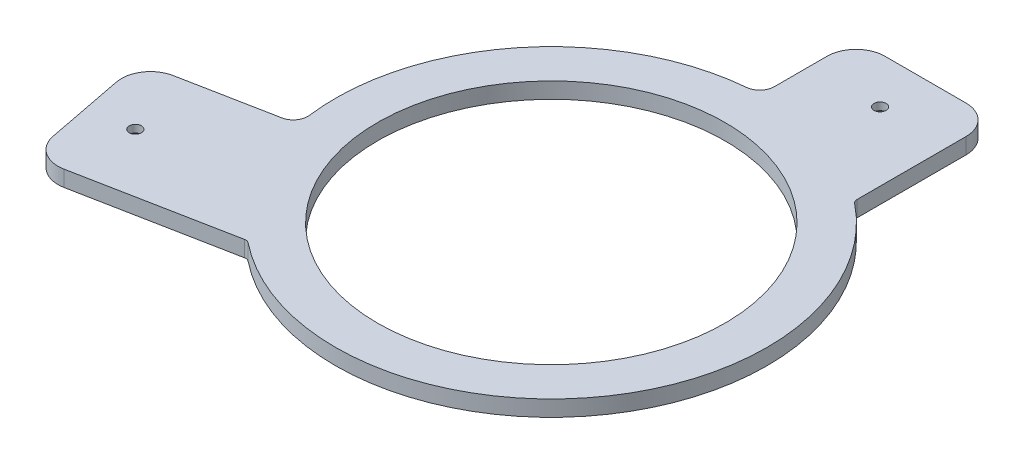
ISO-10303-21;
HEADER;
FILE_DESCRIPTION(('STEP AP214'),'2;1');
FILE_NAME('part.step','',(''),(''),'','','');
FILE_SCHEMA(('AUTOMOTIVE_DESIGN { 1 0 10303 214 1 1 1 1 }'));
ENDSEC;
DATA;
#1=APPLICATION_CONTEXT('core data for automotive mechanical design processes');
#2=APPLICATION_PROTOCOL_DEFINITION('international standard','automotive_design',2000,#1);
#3=PRODUCT_CONTEXT('',#1,'mechanical');
#4=PRODUCT('Part','Part','',(#3));
#5=PRODUCT_RELATED_PRODUCT_CATEGORY('part','',(#4));
#6=PRODUCT_DEFINITION_FORMATION('','',#4);
#7=PRODUCT_DEFINITION_CONTEXT('part definition',#1,'design');
#8=PRODUCT_DEFINITION('design','',#6,#7);
#9=PRODUCT_DEFINITION_SHAPE('','',#8);
#10=(LENGTH_UNIT() NAMED_UNIT(*) SI_UNIT(.MILLI.,.METRE.));
#11=(NAMED_UNIT(*) PLANE_ANGLE_UNIT() SI_UNIT($,.RADIAN.));
#12=(NAMED_UNIT(*) SI_UNIT($,.STERADIAN.) SOLID_ANGLE_UNIT());
#13=UNCERTAINTY_MEASURE_WITH_UNIT(LENGTH_MEASURE(1.E-05),#10,'distance_accuracy_value','');
#14=(GEOMETRIC_REPRESENTATION_CONTEXT(3) GLOBAL_UNCERTAINTY_ASSIGNED_CONTEXT((#13)) GLOBAL_UNIT_ASSIGNED_CONTEXT((#10,
#11,#12)) REPRESENTATION_CONTEXT('',''));
#15=CARTESIAN_POINT('',(0.,0.,0.));
#16=DIRECTION('',(0.,0.,1.));
#17=DIRECTION('',(1.,0.,0.));
#18=AXIS2_PLACEMENT_3D('',#15,#16,#17);
#19=CARTESIAN_POINT('',(0.,5.5,0.));
#20=DIRECTION('',(0.,1.,0.));
#21=DIRECTION('',(0.,0.,1.));
#22=AXIS2_PLACEMENT_3D('',#19,#20,#21);
#23=PLANE('',#22);
#24=CARTESIAN_POINT('',(22.1,5.50000000000001,-91.4));
#25=DIRECTION('',(0.,-1.,0.));
#26=DIRECTION('',(0.,0.,-1.));
#27=AXIS2_PLACEMENT_3D('',#24,#25,#26);
#28=CIRCLE('',#27,2.09999999999999);
#29=CARTESIAN_POINT('',(22.1,5.50000000000001,-93.5));
#30=VERTEX_POINT('',#29);
#31=EDGE_CURVE('E471',#30,#30,#28,.T.);
#32=ORIENTED_EDGE('',*,*,#31,.T.);
#33=EDGE_LOOP('',(#32));
#34=FACE_BOUND('',#33,.T.);
#35=CARTESIAN_POINT('',(-99.7675537114497,5.50000000000001,43.8420486112704));
#36=DIRECTION('',(0.,-1.,0.));
#37=DIRECTION('',(0.,0.,-1.));
#38=AXIS2_PLACEMENT_3D('',#35,#36,#37);
#39=CIRCLE('',#38,2.09999999999999);
#40=CARTESIAN_POINT('',(-99.7675537114497,5.50000000000001,41.7420486112704));
#41=VERTEX_POINT('',#40);
#42=EDGE_CURVE('E290',#41,#41,#39,.T.);
#43=ORIENTED_EDGE('',*,*,#42,.T.);
#44=EDGE_LOOP('',(#43));
#45=FACE_BOUND('',#44,.T.);
#46=CARTESIAN_POINT('',(0.,5.5,0.));
#47=DIRECTION('',(0.,1.,0.));
#48=DIRECTION('',(0.,0.,1.));
#49=AXIS2_PLACEMENT_3D('',#46,#47,#48);
#50=CIRCLE('',#49,74.5);
#51=CARTESIAN_POINT('',(-46.3600724543547,5.5,58.3180390790619));
#52=VERTEX_POINT('',#51);
#53=CARTESIAN_POINT('',(46.6050228310502,5.5,-58.1224728217691));
#54=VERTEX_POINT('',#53);
#55=EDGE_CURVE('E159',#52,#54,#50,.T.);
#56=ORIENTED_EDGE('',*,*,#55,.T.);
#57=CARTESIAN_POINT('',(47.95,5.5,-59.7998327756859));
#58=DIRECTION('',(0.,1.,0.));
#59=DIRECTION('',(0.,0.,1.));
#60=AXIS2_PLACEMENT_3D('',#57,#58,#59);
#61=CIRCLE('',#60,2.15);
#62=CARTESIAN_POINT('',(45.8,5.5,-59.7998327756859));
#63=VERTEX_POINT('',#62);
#64=EDGE_CURVE('E11',#54,#63,#61,.F.);
#65=ORIENTED_EDGE('',*,*,#64,.T.);
#66=DIRECTION('',(0.,0.,-1.));
#67=VECTOR('',#66,1.);
#68=CARTESIAN_POINT('',(45.8,5.5,-107.4));
#69=LINE('',#68,#67);
#70=CARTESIAN_POINT('',(45.8,5.5,-97.4));
#71=VERTEX_POINT('',#70);
#72=EDGE_CURVE('E252',#63,#71,#69,.T.);
#73=ORIENTED_EDGE('',*,*,#72,.T.);
#74=CARTESIAN_POINT('',(35.8,5.5,-97.4));
#75=DIRECTION('',(0.,1.,0.));
#76=DIRECTION('',(0.,0.,1.));
#77=AXIS2_PLACEMENT_3D('',#74,#75,#76);
#78=CIRCLE('',#77,10.);
#79=CARTESIAN_POINT('',(35.8,5.5,-107.4));
#80=VERTEX_POINT('',#79);
#81=EDGE_CURVE('E211',#71,#80,#78,.T.);
#82=ORIENTED_EDGE('',*,*,#81,.T.);
#83=DIRECTION('',(-1.,0.,0.));
#84=VECTOR('',#83,1.);
#85=CARTESIAN_POINT('',(-2.2,5.5,-107.4));
#86=LINE('',#85,#84);
#87=CARTESIAN_POINT('',(7.80000000000001,5.5,-107.4));
#88=VERTEX_POINT('',#87);
#89=EDGE_CURVE('E264',#80,#88,#86,.T.);
#90=ORIENTED_EDGE('',*,*,#89,.T.);
#91=CARTESIAN_POINT('',(7.8,5.5,-97.4));
#92=DIRECTION('',(0.,1.,0.));
#93=DIRECTION('',(0.,0.,1.));
#94=AXIS2_PLACEMENT_3D('',#91,#92,#93);
#95=CIRCLE('',#94,10.);
#96=CARTESIAN_POINT('',(-2.2,5.5,-97.4));
#97=VERTEX_POINT('',#96);
#98=EDGE_CURVE('E209',#88,#97,#95,.T.);
#99=ORIENTED_EDGE('',*,*,#98,.T.);
#100=DIRECTION('',(0.,0.,1.));
#101=VECTOR('',#100,1.);
#102=CARTESIAN_POINT('',(-2.2,5.5,-107.4));
#103=LINE('',#102,#101);
#104=CARTESIAN_POINT('',(-2.19999999999999,5.5,-79.1732909509261));
#105=VERTEX_POINT('',#104);
#106=EDGE_CURVE('E269',#97,#105,#103,.T.);
#107=ORIENTED_EDGE('',*,*,#106,.T.);
#108=CARTESIAN_POINT('',(-7.19999999999999,5.5,-79.1732909509261));
#109=DIRECTION('',(0.,1.,0.));
#110=DIRECTION('',(0.,0.,1.));
#111=AXIS2_PLACEMENT_3D('',#108,#109,#110);
#112=CIRCLE('',#111,5.);
#113=CARTESIAN_POINT('',(-6.74716981132075,5.5,-74.1938386898616));
#114=VERTEX_POINT('',#113);
#115=EDGE_CURVE('E239',#105,#114,#112,.F.);
#116=ORIENTED_EDGE('',*,*,#115,.T.);
#117=CARTESIAN_POINT('',(0.,5.5,0.));
#118=DIRECTION('',(0.,1.,0.));
#119=DIRECTION('',(0.,0.,1.));
#120=AXIS2_PLACEMENT_3D('',#117,#118,#119);
#121=CIRCLE('',#120,74.5);
#122=CARTESIAN_POINT('',(-73.8804872688828,5.5,9.58767964173002));
#123=VERTEX_POINT('',#122);
#124=EDGE_CURVE('E272',#114,#123,#121,.T.);
#125=ORIENTED_EDGE('',*,*,#124,.T.);
#126=CARTESIAN_POINT('',(-78.8389092332374,5.5,10.2311480740609));
#127=DIRECTION('',(0.,1.,0.));
#128=DIRECTION('',(0.,0.,1.));
#129=AXIS2_PLACEMENT_3D('',#126,#127,#128);
#130=CIRCLE('',#129,5.);
#131=CARTESIAN_POINT('',(-77.8848642563547,5.5,15.1392839912992));
#132=VERTEX_POINT('',#131);
#133=EDGE_CURVE('E243',#123,#132,#130,.F.);
#134=ORIENTED_EDGE('',*,*,#133,.T.);
#135=DIRECTION('',(-0.981627183447664,0.,0.190808995376542));
#136=VECTOR('',#135,1.);
#137=CARTESIAN_POINT('',(-119.071377352202,5.5,23.1451311391745));
#138=LINE('',#137,#136);
#139=CARTESIAN_POINT('',(-109.255105517725,5.5,21.2370411854091));
#140=VERTEX_POINT('',#139);
#141=EDGE_CURVE('E160',#132,#140,#138,.T.);
#142=ORIENTED_EDGE('',*,*,#141,.T.);
#143=CARTESIAN_POINT('',(-107.34701556396,5.5,31.0533130198858));
#144=DIRECTION('',(0.,1.,0.));
#145=DIRECTION('',(0.,0.,1.));
#146=AXIS2_PLACEMENT_3D('',#143,#144,#145);
#147=CIRCLE('',#146,10.);
#148=CARTESIAN_POINT('',(-117.163287398436,5.5,32.9614029736512));
#149=VERTEX_POINT('',#148);
#150=EDGE_CURVE('E207',#140,#149,#147,.T.);
#151=ORIENTED_EDGE('',*,*,#150,.T.);
#152=DIRECTION('',(0.190808995376542,0.,0.981627183447665));
#153=VECTOR('',#152,1.);
#154=CARTESIAN_POINT('',(-119.071377352202,5.5,23.1451311391745));
#155=LINE('',#154,#153);
#156=CARTESIAN_POINT('',(-111.877878226506,5.5,60.1524759551515));
#157=VERTEX_POINT('',#156);
#158=EDGE_CURVE('E183',#149,#157,#155,.T.);
#159=ORIENTED_EDGE('',*,*,#158,.T.);
#160=CARTESIAN_POINT('',(-102.061606392029,5.5,58.2443860013861));
#161=DIRECTION('',(0.,1.,0.));
#162=DIRECTION('',(0.,0.,1.));
#163=AXIS2_PLACEMENT_3D('',#160,#161,#162);
#164=CIRCLE('',#163,10.);
#165=CARTESIAN_POINT('',(-100.153516438264,5.5,68.0606578358627));
#166=VERTEX_POINT('',#165);
#167=EDGE_CURVE('E205',#157,#166,#164,.T.);
#168=ORIENTED_EDGE('',*,*,#167,.T.);
#169=DIRECTION('',(0.981627183447664,0.,-0.190808995376542));
#170=VECTOR('',#169,1.);
#171=CARTESIAN_POINT('',(-109.969788272741,5.5,69.9687477896281));
#172=LINE('',#171,#170);
#173=CARTESIAN_POINT('',(-47.9862561485804,5.5,57.9203696538863));
#174=VERTEX_POINT('',#173);
#175=EDGE_CURVE('E297',#166,#174,#172,.T.);
#176=ORIENTED_EDGE('',*,*,#175,.T.);
#177=CARTESIAN_POINT('',(-47.6046381578273,5.5,59.8836240207817));
#178=DIRECTION('',(0.,1.,0.));
#179=DIRECTION('',(0.,0.,1.));
#180=AXIS2_PLACEMENT_3D('',#177,#178,#179);
#181=CIRCLE('',#180,2.);
#182=EDGE_CURVE('E155',#174,#52,#181,.F.);
#183=ORIENTED_EDGE('',*,*,#182,.T.);
#184=EDGE_LOOP('',(#56,#65,#73,#82,#90,#99,#107,#116,#125,#134,#142,#151,#159,#168,#176,#183));
#185=FACE_BOUND('',#184,.T.);
#186=CARTESIAN_POINT('',(0.,5.5,0.));
#187=DIRECTION('',(0.,1.,0.));
#188=DIRECTION('',(0.,0.,1.));
#189=AXIS2_PLACEMENT_3D('',#186,#187,#188);
#190=CIRCLE('',#189,60.);
#191=CARTESIAN_POINT('',(0.,5.5,60.));
#192=VERTEX_POINT('',#191);
#193=EDGE_CURVE('E280',#192,#192,#190,.T.);
#194=ORIENTED_EDGE('',*,*,#193,.F.);
#195=EDGE_LOOP('',(#194));
#196=FACE_BOUND('',#195,.T.);
#197=ADVANCED_FACE('F33',(#34,#45,#185,#196),#23,.T.);
#198=CARTESIAN_POINT('',(0.,0.,0.));
#199=DIRECTION('',(0.,1.,0.));
#200=DIRECTION('',(0.,0.,1.));
#201=AXIS2_PLACEMENT_3D('',#198,#199,#200);
#202=PLANE('',#201);
#203=CARTESIAN_POINT('',(22.1,0.,-91.4));
#204=DIRECTION('',(0.,-1.,0.));
#205=DIRECTION('',(0.,0.,-1.));
#206=AXIS2_PLACEMENT_3D('',#203,#204,#205);
#207=CIRCLE('',#206,5.);
#208=CARTESIAN_POINT('',(22.1,0.,-96.4));
#209=VERTEX_POINT('',#208);
#210=EDGE_CURVE('E469',#209,#209,#207,.T.);
#211=ORIENTED_EDGE('',*,*,#210,.F.);
#212=EDGE_LOOP('',(#211));
#213=FACE_BOUND('',#212,.T.);
#214=CARTESIAN_POINT('',(-99.7675537114497,0.,43.8420486112704));
#215=DIRECTION('',(0.,-1.,0.));
#216=DIRECTION('',(0.,0.,-1.));
#217=AXIS2_PLACEMENT_3D('',#214,#215,#216);
#218=CIRCLE('',#217,5.);
#219=CARTESIAN_POINT('',(-99.7675537114497,0.,38.8420486112704));
#220=VERTEX_POINT('',#219);
#221=EDGE_CURVE('E475',#220,#220,#218,.T.);
#222=ORIENTED_EDGE('',*,*,#221,.F.);
#223=EDGE_LOOP('',(#222));
#224=FACE_BOUND('',#223,.T.);
#225=DIRECTION('',(-1.,0.,0.));
#226=VECTOR('',#225,1.);
#227=CARTESIAN_POINT('',(-2.2,0.,-107.4));
#228=LINE('',#227,#226);
#229=CARTESIAN_POINT('',(35.8,0.,-107.4));
#230=VERTEX_POINT('',#229);
#231=CARTESIAN_POINT('',(7.80000000000001,0.,-107.4));
#232=VERTEX_POINT('',#231);
#233=EDGE_CURVE('E168',#230,#232,#228,.T.);
#234=ORIENTED_EDGE('',*,*,#233,.F.);
#235=CARTESIAN_POINT('',(35.8,0.,-97.4));
#236=DIRECTION('',(0.,1.,0.));
#237=DIRECTION('',(0.,0.,1.));
#238=AXIS2_PLACEMENT_3D('',#235,#236,#237);
#239=CIRCLE('',#238,10.);
#240=CARTESIAN_POINT('',(45.8,0.,-97.4));
#241=VERTEX_POINT('',#240);
#242=EDGE_CURVE('E199',#230,#241,#239,.F.);
#243=ORIENTED_EDGE('',*,*,#242,.T.);
#244=DIRECTION('',(0.,0.,-1.));
#245=VECTOR('',#244,1.);
#246=CARTESIAN_POINT('',(45.8,0.,-107.4));
#247=LINE('',#246,#245);
#248=CARTESIAN_POINT('',(45.8,0.,-59.7998327756859));
#249=VERTEX_POINT('',#248);
#250=EDGE_CURVE('E165',#249,#241,#247,.T.);
#251=ORIENTED_EDGE('',*,*,#250,.F.);
#252=CARTESIAN_POINT('',(47.95,0.,-59.7998327756859));
#253=DIRECTION('',(0.,1.,0.));
#254=DIRECTION('',(0.,0.,1.));
#255=AXIS2_PLACEMENT_3D('',#252,#253,#254);
#256=CIRCLE('',#255,2.15);
#257=CARTESIAN_POINT('',(46.6050228310502,0.,-58.1224728217691));
#258=VERTEX_POINT('',#257);
#259=EDGE_CURVE('E41',#249,#258,#256,.T.);
#260=ORIENTED_EDGE('',*,*,#259,.T.);
#261=CARTESIAN_POINT('',(0.,0.,0.));
#262=DIRECTION('',(0.,1.,0.));
#263=DIRECTION('',(0.,0.,1.));
#264=AXIS2_PLACEMENT_3D('',#261,#262,#263);
#265=CIRCLE('',#264,74.5);
#266=CARTESIAN_POINT('',(-46.3600724543547,0.,58.3180390790619));
#267=VERTEX_POINT('',#266);
#268=EDGE_CURVE('E158',#267,#258,#265,.T.);
#269=ORIENTED_EDGE('',*,*,#268,.F.);
#270=CARTESIAN_POINT('',(-47.6046381578273,0.,59.8836240207817));
#271=DIRECTION('',(0.,1.,0.));
#272=DIRECTION('',(0.,0.,1.));
#273=AXIS2_PLACEMENT_3D('',#270,#271,#272);
#274=CIRCLE('',#273,2.);
#275=CARTESIAN_POINT('',(-47.9862561485804,0.,57.9203696538863));
#276=VERTEX_POINT('',#275);
#277=EDGE_CURVE('E147',#267,#276,#274,.T.);
#278=ORIENTED_EDGE('',*,*,#277,.T.);
#279=DIRECTION('',(0.981627183447664,0.,-0.190808995376542));
#280=VECTOR('',#279,1.);
#281=CARTESIAN_POINT('',(-109.969788272741,0.,69.9687477896281));
#282=LINE('',#281,#280);
#283=CARTESIAN_POINT('',(-100.153516438264,0.,68.0606578358627));
#284=VERTEX_POINT('',#283);
#285=EDGE_CURVE('E166',#284,#276,#282,.T.);
#286=ORIENTED_EDGE('',*,*,#285,.F.);
#287=CARTESIAN_POINT('',(-102.061606392029,0.,58.2443860013861));
#288=DIRECTION('',(0.,1.,0.));
#289=DIRECTION('',(0.,0.,1.));
#290=AXIS2_PLACEMENT_3D('',#287,#288,#289);
#291=CIRCLE('',#290,10.);
#292=CARTESIAN_POINT('',(-111.877878226506,0.,60.1524759551515));
#293=VERTEX_POINT('',#292);
#294=EDGE_CURVE('E192',#284,#293,#291,.F.);
#295=ORIENTED_EDGE('',*,*,#294,.T.);
#296=DIRECTION('',(0.190808995376542,0.,0.981627183447665));
#297=VECTOR('',#296,1.);
#298=CARTESIAN_POINT('',(-119.071377352202,0.,23.1451311391745));
#299=LINE('',#298,#297);
#300=CARTESIAN_POINT('',(-117.163287398436,0.,32.9614029736512));
#301=VERTEX_POINT('',#300);
#302=EDGE_CURVE('E170',#301,#293,#299,.T.);
#303=ORIENTED_EDGE('',*,*,#302,.F.);
#304=CARTESIAN_POINT('',(-107.34701556396,0.,31.0533130198858));
#305=DIRECTION('',(0.,1.,0.));
#306=DIRECTION('',(0.,0.,1.));
#307=AXIS2_PLACEMENT_3D('',#304,#305,#306);
#308=CIRCLE('',#307,10.);
#309=CARTESIAN_POINT('',(-109.255105517725,0.,21.2370411854091));
#310=VERTEX_POINT('',#309);
#311=EDGE_CURVE('E194',#301,#310,#308,.F.);
#312=ORIENTED_EDGE('',*,*,#311,.T.);
#313=DIRECTION('',(-0.981627183447664,0.,0.190808995376542));
#314=VECTOR('',#313,1.);
#315=CARTESIAN_POINT('',(-119.071377352202,0.,23.1451311391745));
#316=LINE('',#315,#314);
#317=CARTESIAN_POINT('',(-77.8848642563547,0.,15.1392839912992));
#318=VERTEX_POINT('',#317);
#319=EDGE_CURVE('E182',#318,#310,#316,.T.);
#320=ORIENTED_EDGE('',*,*,#319,.F.);
#321=CARTESIAN_POINT('',(-78.8389092332374,0.,10.2311480740609));
#322=DIRECTION('',(0.,1.,0.));
#323=DIRECTION('',(0.,0.,1.));
#324=AXIS2_PLACEMENT_3D('',#321,#322,#323);
#325=CIRCLE('',#324,5.);
#326=CARTESIAN_POINT('',(-73.8804872688828,0.,9.58767964173002));
#327=VERTEX_POINT('',#326);
#328=EDGE_CURVE('E241',#318,#327,#325,.T.);
#329=ORIENTED_EDGE('',*,*,#328,.T.);
#330=CARTESIAN_POINT('',(0.,0.,0.));
#331=DIRECTION('',(0.,1.,0.));
#332=DIRECTION('',(0.,0.,1.));
#333=AXIS2_PLACEMENT_3D('',#330,#331,#332);
#334=CIRCLE('',#333,74.5);
#335=CARTESIAN_POINT('',(-6.74716981132075,0.,-74.1938386898616));
#336=VERTEX_POINT('',#335);
#337=EDGE_CURVE('E179',#336,#327,#334,.T.);
#338=ORIENTED_EDGE('',*,*,#337,.F.);
#339=CARTESIAN_POINT('',(-7.19999999999999,0.,-79.1732909509261));
#340=DIRECTION('',(0.,1.,0.));
#341=DIRECTION('',(0.,0.,1.));
#342=AXIS2_PLACEMENT_3D('',#339,#340,#341);
#343=CIRCLE('',#342,5.);
#344=CARTESIAN_POINT('',(-2.19999999999999,0.,-79.1732909509261));
#345=VERTEX_POINT('',#344);
#346=EDGE_CURVE('E237',#336,#345,#343,.T.);
#347=ORIENTED_EDGE('',*,*,#346,.T.);
#348=DIRECTION('',(0.,0.,1.));
#349=VECTOR('',#348,1.);
#350=CARTESIAN_POINT('',(-2.2,0.,-107.4));
#351=LINE('',#350,#349);
#352=CARTESIAN_POINT('',(-2.2,0.,-97.4));
#353=VERTEX_POINT('',#352);
#354=EDGE_CURVE('E176',#353,#345,#351,.T.);
#355=ORIENTED_EDGE('',*,*,#354,.F.);
#356=CARTESIAN_POINT('',(7.8,0.,-97.4));
#357=DIRECTION('',(0.,1.,0.));
#358=DIRECTION('',(0.,0.,1.));
#359=AXIS2_PLACEMENT_3D('',#356,#357,#358);
#360=CIRCLE('',#359,10.);
#361=EDGE_CURVE('E197',#353,#232,#360,.F.);
#362=ORIENTED_EDGE('',*,*,#361,.T.);
#363=EDGE_LOOP('',(#234,#243,#251,#260,#269,#278,#286,#295,#303,#312,#320,#329,#338,#347,#355,#362));
#364=FACE_BOUND('',#363,.T.);
#365=CARTESIAN_POINT('',(0.,0.,0.));
#366=DIRECTION('',(0.,1.,0.));
#367=DIRECTION('',(0.,0.,1.));
#368=AXIS2_PLACEMENT_3D('',#365,#366,#367);
#369=CIRCLE('',#368,60.);
#370=CARTESIAN_POINT('',(0.,0.,60.));
#371=VERTEX_POINT('',#370);
#372=EDGE_CURVE('E285',#371,#371,#369,.T.);
#373=ORIENTED_EDGE('',*,*,#372,.T.);
#374=EDGE_LOOP('',(#373));
#375=FACE_BOUND('',#374,.T.);
#376=ADVANCED_FACE('F163',(#213,#224,#364,#375),#202,.F.);
#377=CARTESIAN_POINT('',(-119.071377352202,5.5,23.1451311391745));
#378=DIRECTION('',(0.981627183447665,0.,-0.190808995376542));
#379=DIRECTION('',(-0.190808995376542,0.,-0.981627183447665));
#380=AXIS2_PLACEMENT_3D('',#377,#378,#379);
#381=PLANE('',#380);
#382=ORIENTED_EDGE('',*,*,#158,.F.);
#383=DIRECTION('',(0.,-1.,0.));
#384=VECTOR('',#383,1.);
#385=CARTESIAN_POINT('',(-117.163287398436,5.5,32.9614029736512));
#386=LINE('',#385,#384);
#387=EDGE_CURVE('E218',#149,#301,#386,.T.);
#388=ORIENTED_EDGE('',*,*,#387,.T.);
#389=ORIENTED_EDGE('',*,*,#302,.T.);
#390=DIRECTION('',(0.,-1.,0.));
#391=VECTOR('',#390,1.);
#392=CARTESIAN_POINT('',(-111.877878226506,5.5,60.1524759551515));
#393=LINE('',#392,#391);
#394=EDGE_CURVE('E216',#293,#157,#393,.F.);
#395=ORIENTED_EDGE('',*,*,#394,.T.);
#396=EDGE_LOOP('',(#382,#388,#389,#395));
#397=FACE_BOUND('',#396,.T.);
#398=ADVANCED_FACE('F316',(#397),#381,.F.);
#399=CARTESIAN_POINT('',(-109.969788272741,5.5,69.9687477896281));
#400=DIRECTION('',(-0.190808995376542,0.,-0.981627183447664));
#401=DIRECTION('',(-0.981627183447665,0.,0.190808995376542));
#402=AXIS2_PLACEMENT_3D('',#399,#400,#401);
#403=PLANE('',#402);
#404=ORIENTED_EDGE('',*,*,#175,.F.);
#405=DIRECTION('',(0.,-1.,0.));
#406=VECTOR('',#405,1.);
#407=CARTESIAN_POINT('',(-100.153516438264,5.5,68.0606578358627));
#408=LINE('',#407,#406);
#409=EDGE_CURVE('E224',#166,#284,#408,.T.);
#410=ORIENTED_EDGE('',*,*,#409,.T.);
#411=ORIENTED_EDGE('',*,*,#285,.T.);
#412=DIRECTION('',(0.,1.,0.));
#413=VECTOR('',#412,1.);
#414=CARTESIAN_POINT('',(-47.9862561485804,5.5,57.9203696538863));
#415=LINE('',#414,#413);
#416=EDGE_CURVE('E153',#276,#174,#415,.T.);
#417=ORIENTED_EDGE('',*,*,#416,.T.);
#418=EDGE_LOOP('',(#404,#410,#411,#417));
#419=FACE_BOUND('',#418,.T.);
#420=ADVANCED_FACE('F342',(#419),#403,.F.);
#421=CARTESIAN_POINT('',(0.,5.5,0.));
#422=DIRECTION('',(0.,-1.,0.));
#423=DIRECTION('',(0.,0.,-1.));
#424=AXIS2_PLACEMENT_3D('',#421,#422,#423);
#425=CYLINDRICAL_SURFACE('',#424,74.5);
#426=ORIENTED_EDGE('',*,*,#268,.T.);
#427=DIRECTION('',(0.,-1.,0.));
#428=VECTOR('',#427,1.);
#429=CARTESIAN_POINT('',(46.6050228310502,5.5,-58.1224728217691));
#430=LINE('',#429,#428);
#431=EDGE_CURVE('E54',#258,#54,#430,.F.);
#432=ORIENTED_EDGE('',*,*,#431,.T.);
#433=ORIENTED_EDGE('',*,*,#55,.F.);
#434=DIRECTION('',(0.,-1.,0.));
#435=VECTOR('',#434,1.);
#436=CARTESIAN_POINT('',(-46.3600724543547,5.5,58.3180390790619));
#437=LINE('',#436,#435);
#438=EDGE_CURVE('E151',#52,#267,#437,.T.);
#439=ORIENTED_EDGE('',*,*,#438,.T.);
#440=EDGE_LOOP('',(#426,#432,#433,#439));
#441=FACE_BOUND('',#440,.T.);
#442=ADVANCED_FACE('F157',(#441),#425,.T.);
#443=CARTESIAN_POINT('',(45.8,5.5,-107.4));
#444=DIRECTION('',(-1.,0.,0.));
#445=DIRECTION('',(0.,0.,1.));
#446=AXIS2_PLACEMENT_3D('',#443,#444,#445);
#447=PLANE('',#446);
#448=ORIENTED_EDGE('',*,*,#72,.F.);
#449=DIRECTION('',(0.,1.,0.));
#450=VECTOR('',#449,1.);
#451=CARTESIAN_POINT('',(45.8,0.,-59.7998327756859));
#452=LINE('',#451,#450);
#453=EDGE_CURVE('E245',#63,#249,#452,.F.);
#454=ORIENTED_EDGE('',*,*,#453,.T.);
#455=ORIENTED_EDGE('',*,*,#250,.T.);
#456=DIRECTION('',(0.,-1.,0.));
#457=VECTOR('',#456,1.);
#458=CARTESIAN_POINT('',(45.8,5.5,-97.4));
#459=LINE('',#458,#457);
#460=EDGE_CURVE('E202',#241,#71,#459,.F.);
#461=ORIENTED_EDGE('',*,*,#460,.T.);
#462=EDGE_LOOP('',(#448,#454,#455,#461));
#463=FACE_BOUND('',#462,.T.);
#464=ADVANCED_FACE('F251',(#463),#447,.F.);
#465=CARTESIAN_POINT('',(-2.2,5.5,-107.4));
#466=DIRECTION('',(0.,0.,1.));
#467=DIRECTION('',(1.,0.,0.));
#468=AXIS2_PLACEMENT_3D('',#465,#466,#467);
#469=PLANE('',#468);
#470=ORIENTED_EDGE('',*,*,#89,.F.);
#471=DIRECTION('',(0.,-1.,0.));
#472=VECTOR('',#471,1.);
#473=CARTESIAN_POINT('',(35.8,5.5,-107.4));
#474=LINE('',#473,#472);
#475=EDGE_CURVE('E189',#80,#230,#474,.T.);
#476=ORIENTED_EDGE('',*,*,#475,.T.);
#477=ORIENTED_EDGE('',*,*,#233,.T.);
#478=DIRECTION('',(0.,-1.,0.));
#479=VECTOR('',#478,1.);
#480=CARTESIAN_POINT('',(7.80000000000001,5.5,-107.4));
#481=LINE('',#480,#479);
#482=EDGE_CURVE('E187',#232,#88,#481,.F.);
#483=ORIENTED_EDGE('',*,*,#482,.T.);
#484=EDGE_LOOP('',(#470,#476,#477,#483));
#485=FACE_BOUND('',#484,.T.);
#486=ADVANCED_FACE('F267',(#485),#469,.F.);
#487=CARTESIAN_POINT('',(-2.2,5.5,-107.4));
#488=DIRECTION('',(1.,0.,0.));
#489=DIRECTION('',(0.,0.,-1.));
#490=AXIS2_PLACEMENT_3D('',#487,#488,#489);
#491=PLANE('',#490);
#492=ORIENTED_EDGE('',*,*,#354,.T.);
#493=DIRECTION('',(0.,1.,0.));
#494=VECTOR('',#493,1.);
#495=CARTESIAN_POINT('',(-2.19999999999999,5.5,-79.1732909509261));
#496=LINE('',#495,#494);
#497=EDGE_CURVE('E232',#345,#105,#496,.T.);
#498=ORIENTED_EDGE('',*,*,#497,.T.);
#499=ORIENTED_EDGE('',*,*,#106,.F.);
#500=DIRECTION('',(0.,-1.,0.));
#501=VECTOR('',#500,1.);
#502=CARTESIAN_POINT('',(-2.2,5.5,-97.4));
#503=LINE('',#502,#501);
#504=EDGE_CURVE('E213',#97,#353,#503,.T.);
#505=ORIENTED_EDGE('',*,*,#504,.T.);
#506=EDGE_LOOP('',(#492,#498,#499,#505));
#507=FACE_BOUND('',#506,.T.);
#508=ADVANCED_FACE('F331',(#507),#491,.F.);
#509=CARTESIAN_POINT('',(0.,5.5,0.));
#510=DIRECTION('',(0.,-1.,0.));
#511=DIRECTION('',(0.,0.,-1.));
#512=AXIS2_PLACEMENT_3D('',#509,#510,#511);
#513=CYLINDRICAL_SURFACE('',#512,74.5);
#514=ORIENTED_EDGE('',*,*,#124,.F.);
#515=DIRECTION('',(0.,-1.,0.));
#516=VECTOR('',#515,1.);
#517=CARTESIAN_POINT('',(-6.74716981132075,5.5,-74.1938386898616));
#518=LINE('',#517,#516);
#519=EDGE_CURVE('E229',#114,#336,#518,.T.);
#520=ORIENTED_EDGE('',*,*,#519,.T.);
#521=ORIENTED_EDGE('',*,*,#337,.T.);
#522=DIRECTION('',(0.,-1.,0.));
#523=VECTOR('',#522,1.);
#524=CARTESIAN_POINT('',(-73.8804872688828,5.5,9.58767964173002));
#525=LINE('',#524,#523);
#526=EDGE_CURVE('E227',#327,#123,#525,.F.);
#527=ORIENTED_EDGE('',*,*,#526,.T.);
#528=EDGE_LOOP('',(#514,#520,#521,#527));
#529=FACE_BOUND('',#528,.T.);
#530=ADVANCED_FACE('F327',(#529),#513,.T.);
#531=CARTESIAN_POINT('',(-119.071377352202,5.5,23.1451311391745));
#532=DIRECTION('',(0.190808995376542,0.,0.981627183447664));
#533=DIRECTION('',(0.981627183447665,0.,-0.190808995376542));
#534=AXIS2_PLACEMENT_3D('',#531,#532,#533);
#535=PLANE('',#534);
#536=ORIENTED_EDGE('',*,*,#141,.F.);
#537=DIRECTION('',(0.,1.,0.));
#538=VECTOR('',#537,1.);
#539=CARTESIAN_POINT('',(-77.8848642563546,0.,15.1392839912992));
#540=LINE('',#539,#538);
#541=EDGE_CURVE('E234',#132,#318,#540,.F.);
#542=ORIENTED_EDGE('',*,*,#541,.T.);
#543=ORIENTED_EDGE('',*,*,#319,.T.);
#544=DIRECTION('',(0.,-1.,0.));
#545=VECTOR('',#544,1.);
#546=CARTESIAN_POINT('',(-109.255105517725,5.5,21.2370411854091));
#547=LINE('',#546,#545);
#548=EDGE_CURVE('E221',#310,#140,#547,.F.);
#549=ORIENTED_EDGE('',*,*,#548,.T.);
#550=EDGE_LOOP('',(#536,#542,#543,#549));
#551=FACE_BOUND('',#550,.T.);
#552=ADVANCED_FACE('F324',(#551),#535,.F.);
#553=CARTESIAN_POINT('',(0.,5.5,0.));
#554=DIRECTION('',(0.,-1.,0.));
#555=DIRECTION('',(0.,0.,-1.));
#556=AXIS2_PLACEMENT_3D('',#553,#554,#555);
#557=CYLINDRICAL_SURFACE('',#556,60.);
#558=ORIENTED_EDGE('',*,*,#193,.T.);
#559=EDGE_LOOP('',(#558));
#560=FACE_BOUND('',#559,.T.);
#561=ORIENTED_EDGE('',*,*,#372,.F.);
#562=EDGE_LOOP('',(#561));
#563=FACE_BOUND('',#562,.T.);
#564=ADVANCED_FACE('F322',(#560,#563),#557,.F.);
#565=CARTESIAN_POINT('',(-47.6046381578273,5.5,59.8836240207817));
#566=DIRECTION('',(0.,-1.,0.));
#567=DIRECTION('',(0.,0.,-1.));
#568=AXIS2_PLACEMENT_3D('',#565,#566,#567);
#569=CYLINDRICAL_SURFACE('',#568,2.);
#570=ORIENTED_EDGE('',*,*,#182,.F.);
#571=ORIENTED_EDGE('',*,*,#416,.F.);
#572=ORIENTED_EDGE('',*,*,#277,.F.);
#573=ORIENTED_EDGE('',*,*,#438,.F.);
#574=EDGE_LOOP('',(#570,#571,#572,#573));
#575=FACE_BOUND('',#574,.T.);
#576=ADVANCED_FACE('F150',(#575),#569,.F.);
#577=CARTESIAN_POINT('',(35.8,5.5,-97.4));
#578=DIRECTION('',(0.,-1.,0.));
#579=DIRECTION('',(0.,0.,-1.));
#580=AXIS2_PLACEMENT_3D('',#577,#578,#579);
#581=CYLINDRICAL_SURFACE('',#580,10.);
#582=ORIENTED_EDGE('',*,*,#81,.F.);
#583=ORIENTED_EDGE('',*,*,#460,.F.);
#584=ORIENTED_EDGE('',*,*,#242,.F.);
#585=ORIENTED_EDGE('',*,*,#475,.F.);
#586=EDGE_LOOP('',(#582,#583,#584,#585));
#587=FACE_BOUND('',#586,.T.);
#588=ADVANCED_FACE('F259',(#587),#581,.T.);
#589=CARTESIAN_POINT('',(7.8,5.5,-97.4));
#590=DIRECTION('',(0.,-1.,0.));
#591=DIRECTION('',(0.,0.,-1.));
#592=AXIS2_PLACEMENT_3D('',#589,#590,#591);
#593=CYLINDRICAL_SURFACE('',#592,10.);
#594=ORIENTED_EDGE('',*,*,#98,.F.);
#595=ORIENTED_EDGE('',*,*,#482,.F.);
#596=ORIENTED_EDGE('',*,*,#361,.F.);
#597=ORIENTED_EDGE('',*,*,#504,.F.);
#598=EDGE_LOOP('',(#594,#595,#596,#597));
#599=FACE_BOUND('',#598,.T.);
#600=ADVANCED_FACE('F352',(#599),#593,.T.);
#601=CARTESIAN_POINT('',(-107.34701556396,5.5,31.0533130198858));
#602=DIRECTION('',(0.,-1.,0.));
#603=DIRECTION('',(0.,0.,-1.));
#604=AXIS2_PLACEMENT_3D('',#601,#602,#603);
#605=CYLINDRICAL_SURFACE('',#604,10.);
#606=ORIENTED_EDGE('',*,*,#150,.F.);
#607=ORIENTED_EDGE('',*,*,#548,.F.);
#608=ORIENTED_EDGE('',*,*,#311,.F.);
#609=ORIENTED_EDGE('',*,*,#387,.F.);
#610=EDGE_LOOP('',(#606,#607,#608,#609));
#611=FACE_BOUND('',#610,.T.);
#612=ADVANCED_FACE('F355',(#611),#605,.T.);
#613=CARTESIAN_POINT('',(-102.061606392029,5.5,58.2443860013861));
#614=DIRECTION('',(0.,-1.,0.));
#615=DIRECTION('',(0.,0.,-1.));
#616=AXIS2_PLACEMENT_3D('',#613,#614,#615);
#617=CYLINDRICAL_SURFACE('',#616,10.);
#618=ORIENTED_EDGE('',*,*,#167,.F.);
#619=ORIENTED_EDGE('',*,*,#394,.F.);
#620=ORIENTED_EDGE('',*,*,#294,.F.);
#621=ORIENTED_EDGE('',*,*,#409,.F.);
#622=EDGE_LOOP('',(#618,#619,#620,#621));
#623=FACE_BOUND('',#622,.T.);
#624=ADVANCED_FACE('F359',(#623),#617,.T.);
#625=CARTESIAN_POINT('',(-7.19999999999999,5.5,-79.1732909509261));
#626=DIRECTION('',(0.,-1.,0.));
#627=DIRECTION('',(0.,0.,-1.));
#628=AXIS2_PLACEMENT_3D('',#625,#626,#627);
#629=CYLINDRICAL_SURFACE('',#628,5.);
#630=ORIENTED_EDGE('',*,*,#115,.F.);
#631=ORIENTED_EDGE('',*,*,#497,.F.);
#632=ORIENTED_EDGE('',*,*,#346,.F.);
#633=ORIENTED_EDGE('',*,*,#519,.F.);
#634=EDGE_LOOP('',(#630,#631,#632,#633));
#635=FACE_BOUND('',#634,.T.);
#636=ADVANCED_FACE('F308',(#635),#629,.F.);
#637=CARTESIAN_POINT('',(-78.8389092332374,5.5,10.2311480740609));
#638=DIRECTION('',(0.,-1.,0.));
#639=DIRECTION('',(0.,0.,-1.));
#640=AXIS2_PLACEMENT_3D('',#637,#638,#639);
#641=CYLINDRICAL_SURFACE('',#640,5.);
#642=ORIENTED_EDGE('',*,*,#133,.F.);
#643=ORIENTED_EDGE('',*,*,#526,.F.);
#644=ORIENTED_EDGE('',*,*,#328,.F.);
#645=ORIENTED_EDGE('',*,*,#541,.F.);
#646=EDGE_LOOP('',(#642,#643,#644,#645));
#647=FACE_BOUND('',#646,.T.);
#648=ADVANCED_FACE('F300',(#647),#641,.F.);
#649=CARTESIAN_POINT('',(47.95,5.5,-59.7998327756859));
#650=DIRECTION('',(0.,-1.,0.));
#651=DIRECTION('',(0.,0.,-1.));
#652=AXIS2_PLACEMENT_3D('',#649,#650,#651);
#653=CYLINDRICAL_SURFACE('',#652,2.15);
#654=ORIENTED_EDGE('',*,*,#64,.F.);
#655=ORIENTED_EDGE('',*,*,#431,.F.);
#656=ORIENTED_EDGE('',*,*,#259,.F.);
#657=ORIENTED_EDGE('',*,*,#453,.F.);
#658=EDGE_LOOP('',(#654,#655,#656,#657));
#659=FACE_BOUND('',#658,.T.);
#660=ADVANCED_FACE('F35',(#659),#653,.F.);
#661=CARTESIAN_POINT('',(-99.7675537114497,0.,43.8420486112704));
#662=DIRECTION('',(0.,-1.,0.));
#663=DIRECTION('',(0.,0.,-1.));
#664=AXIS2_PLACEMENT_3D('',#661,#662,#663);
#665=CYLINDRICAL_SURFACE('',#664,2.1);
#666=ORIENTED_EDGE('',*,*,#42,.F.);
#667=EDGE_LOOP('',(#666));
#668=FACE_BOUND('',#667,.T.);
#669=CARTESIAN_POINT('',(-99.7675537114497,2.9,43.8420486112704));
#670=DIRECTION('',(0.,-1.,0.));
#671=DIRECTION('',(0.,0.,-1.));
#672=AXIS2_PLACEMENT_3D('',#669,#670,#671);
#673=CIRCLE('',#672,2.1);
#674=CARTESIAN_POINT('',(-99.7675537114497,2.9,41.7420486112703));
#675=VERTEX_POINT('',#674);
#676=EDGE_CURVE('E477',#675,#675,#673,.T.);
#677=ORIENTED_EDGE('',*,*,#676,.T.);
#678=EDGE_LOOP('',(#677));
#679=FACE_BOUND('',#678,.T.);
#680=ADVANCED_FACE('F299',(#668,#679),#665,.F.);
#681=CARTESIAN_POINT('',(-99.7675537114497,0.,43.8420486112704));
#682=DIRECTION('',(0.,-1.,0.));
#683=DIRECTION('',(0.,0.,-1.));
#684=AXIS2_PLACEMENT_3D('',#681,#682,#683);
#685=CONICAL_SURFACE('',#684,5.,0.785398163397448);
#686=ORIENTED_EDGE('',*,*,#676,.F.);
#687=EDGE_LOOP('',(#686));
#688=FACE_BOUND('',#687,.T.);
#689=ORIENTED_EDGE('',*,*,#221,.T.);
#690=EDGE_LOOP('',(#689));
#691=FACE_BOUND('',#690,.T.);
#692=ADVANCED_FACE('F305',(#688,#691),#685,.F.);
#693=CARTESIAN_POINT('',(22.1,0.,-91.4));
#694=DIRECTION('',(0.,-1.,0.));
#695=DIRECTION('',(0.,0.,-1.));
#696=AXIS2_PLACEMENT_3D('',#693,#694,#695);
#697=CYLINDRICAL_SURFACE('',#696,2.09999999999999);
#698=ORIENTED_EDGE('',*,*,#31,.F.);
#699=EDGE_LOOP('',(#698));
#700=FACE_BOUND('',#699,.T.);
#701=CARTESIAN_POINT('',(22.1,2.9,-91.4));
#702=DIRECTION('',(0.,-1.,0.));
#703=DIRECTION('',(0.,0.,-1.));
#704=AXIS2_PLACEMENT_3D('',#701,#702,#703);
#705=CIRCLE('',#704,2.1);
#706=CARTESIAN_POINT('',(22.1,2.9,-93.5));
#707=VERTEX_POINT('',#706);
#708=EDGE_CURVE('E466',#707,#707,#705,.T.);
#709=ORIENTED_EDGE('',*,*,#708,.T.);
#710=EDGE_LOOP('',(#709));
#711=FACE_BOUND('',#710,.T.);
#712=ADVANCED_FACE('F439',(#700,#711),#697,.F.);
#713=CARTESIAN_POINT('',(22.1,0.,-91.4));
#714=DIRECTION('',(0.,-1.,0.));
#715=DIRECTION('',(0.,0.,-1.));
#716=AXIS2_PLACEMENT_3D('',#713,#714,#715);
#717=CONICAL_SURFACE('',#716,5.,0.785398163397448);
#718=ORIENTED_EDGE('',*,*,#708,.F.);
#719=EDGE_LOOP('',(#718));
#720=FACE_BOUND('',#719,.T.);
#721=ORIENTED_EDGE('',*,*,#210,.T.);
#722=EDGE_LOOP('',(#721));
#723=FACE_BOUND('',#722,.T.);
#724=ADVANCED_FACE('F449',(#720,#723),#717,.F.);
#725=CLOSED_SHELL('',(#197,#376,#398,#420,#442,#464,#486,#508,#530,#552,#564,#576,#588,#600,
#612,#624,#636,#648,#660,#680,#692,#712,#724));
#726=MANIFOLD_SOLID_BREP('B2',#725);
#727=ADVANCED_BREP_SHAPE_REPRESENTATION('',(#18,#726),#14);
#728=SHAPE_DEFINITION_REPRESENTATION(#9,#727);
ENDSEC;
END-ISO-10303-21;
